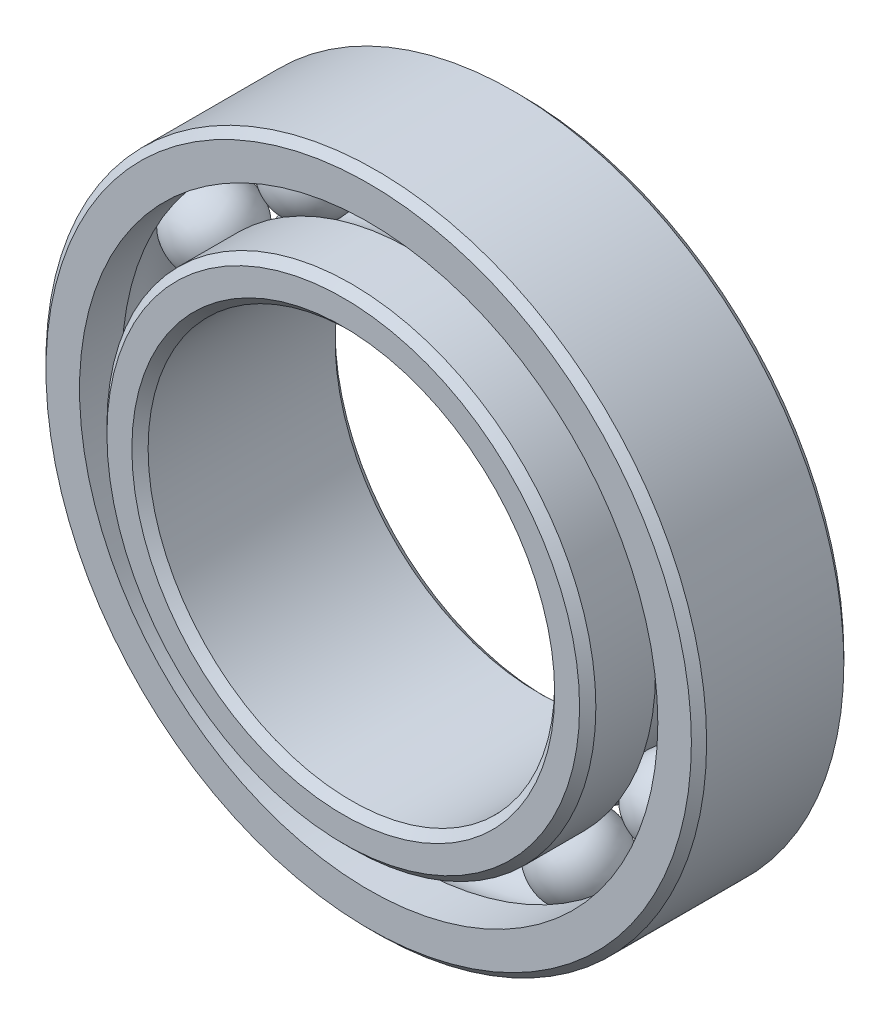
ISO-10303-21;
HEADER;
FILE_DESCRIPTION(('STEP AP214'),'2;1');
FILE_NAME('part.step','',(''),(''),'','','');
FILE_SCHEMA(('AUTOMOTIVE_DESIGN { 1 0 10303 214 1 1 1 1 }'));
ENDSEC;
DATA;
#1=APPLICATION_CONTEXT('core data for automotive mechanical design processes');
#2=APPLICATION_PROTOCOL_DEFINITION('international standard','automotive_design',2000,#1);
#3=PRODUCT_CONTEXT('',#1,'mechanical');
#4=PRODUCT('Part','Part','',(#3));
#5=PRODUCT_RELATED_PRODUCT_CATEGORY('part','',(#4));
#6=PRODUCT_DEFINITION_FORMATION('','',#4);
#7=PRODUCT_DEFINITION_CONTEXT('part definition',#1,'design');
#8=PRODUCT_DEFINITION('design','',#6,#7);
#9=PRODUCT_DEFINITION_SHAPE('','',#8);
#10=(LENGTH_UNIT() NAMED_UNIT(*) SI_UNIT(.MILLI.,.METRE.));
#11=(NAMED_UNIT(*) PLANE_ANGLE_UNIT() SI_UNIT($,.RADIAN.));
#12=(NAMED_UNIT(*) SI_UNIT($,.STERADIAN.) SOLID_ANGLE_UNIT());
#13=UNCERTAINTY_MEASURE_WITH_UNIT(LENGTH_MEASURE(1.E-05),#10,'distance_accuracy_value','');
#14=(GEOMETRIC_REPRESENTATION_CONTEXT(3) GLOBAL_UNCERTAINTY_ASSIGNED_CONTEXT((#13)) GLOBAL_UNIT_ASSIGNED_CONTEXT((#10,
#11,#12)) REPRESENTATION_CONTEXT('',''));
#15=CARTESIAN_POINT('',(0.,0.,0.));
#16=DIRECTION('',(0.,0.,1.));
#17=DIRECTION('',(1.,0.,0.));
#18=AXIS2_PLACEMENT_3D('',#15,#16,#17);
#19=CARTESIAN_POINT('',(-8.334375,14.4355609493326,0.));
#20=DIRECTION('',(0.,0.,1.0000000000001));
#21=DIRECTION('',(0.499999999999989,-0.866025403784445,0.));
#22=AXIS2_PLACEMENT_3D('',#19,#20,#21);
#23=SPHERICAL_SURFACE('',#22,2.53534798534798);
#24=CARTESIAN_POINT('',(-8.334375,14.4355609493326,2.53534798534823));
#25=VERTEX_POINT('',#24);
#26=VERTEX_LOOP('',#25);
#27=FACE_BOUND('',#26,.T.);
#28=ADVANCED_FACE('F43',(#27),#23,.T.);
#29=CLOSED_SHELL('',(#28));
#30=MANIFOLD_SOLID_BREP('B2',#29);
#31=CARTESIAN_POINT('',(-14.4355609493315,8.33437500000032,-1.23859256184744E-12));
#32=DIRECTION('',(0.,0.,1.0000000000001));
#33=DIRECTION('',(0.866025403784432,-0.50000000000001,0.));
#34=AXIS2_PLACEMENT_3D('',#31,#32,#33);
#35=SPHERICAL_SURFACE('',#34,2.53534798534798);
#36=CARTESIAN_POINT('',(-14.4355609493315,8.33437500000032,2.53534798534699));
#37=VERTEX_POINT('',#36);
#38=VERTEX_LOOP('',#37);
#39=FACE_BOUND('',#38,.T.);
#40=ADVANCED_FACE('F61',(#39),#35,.T.);
#41=CLOSED_SHELL('',(#40));
#42=MANIFOLD_SOLID_BREP('B6',#41);
#43=CARTESIAN_POINT('',(-16.6687499999997,1.73472347597681E-13,-1.21083698623181E-12));
#44=DIRECTION('',(0.,0.,1.0000000000001));
#45=DIRECTION('',(0.999999999999984,0.,0.));
#46=AXIS2_PLACEMENT_3D('',#43,#44,#45);
#47=SPHERICAL_SURFACE('',#46,2.53534798534798);
#48=CARTESIAN_POINT('',(-16.6687499999997,1.7344211046995E-13,2.53534798534702));
#49=VERTEX_POINT('',#48);
#50=VERTEX_LOOP('',#49);
#51=FACE_BOUND('',#50,.T.);
#52=ADVANCED_FACE('F79',(#51),#47,.T.);
#53=CLOSED_SHELL('',(#52));
#54=MANIFOLD_SOLID_BREP('B39',#53);
#55=CARTESIAN_POINT('',(-14.4355609493316,-8.3343749999995,-1.26634813746307E-12));
#56=DIRECTION('',(0.,0.,1.0000000000001));
#57=DIRECTION('',(0.866025403784443,0.499999999999992,0.));
#58=AXIS2_PLACEMENT_3D('',#55,#56,#57);
#59=SPHERICAL_SURFACE('',#58,2.53534798534798);
#60=CARTESIAN_POINT('',(-14.4355609493316,-8.3343749999995,2.53534798534697));
#61=VERTEX_POINT('',#60);
#62=VERTEX_LOOP('',#61);
#63=FACE_BOUND('',#62,.T.);
#64=ADVANCED_FACE('F97',(#63),#59,.T.);
#65=CLOSED_SHELL('',(#64));
#66=MANIFOLD_SOLID_BREP('B57',#65);
#67=CARTESIAN_POINT('',(-8.33437499999973,-14.4355609493317,-1.28369537222284E-12));
#68=DIRECTION('',(0.,0.,1.0000000000001));
#69=DIRECTION('',(0.500000000000002,0.866025403784435,0.));
#70=AXIS2_PLACEMENT_3D('',#67,#68,#69);
#71=SPHERICAL_SURFACE('',#70,2.53534798534798);
#72=CARTESIAN_POINT('',(-8.33437499999973,-14.4355609493317,2.53534798534694));
#73=VERTEX_POINT('',#72);
#74=VERTEX_LOOP('',#73);
#75=FACE_BOUND('',#74,.T.);
#76=ADVANCED_FACE('F115',(#75),#71,.T.);
#77=CLOSED_SHELL('',(#76));
#78=MANIFOLD_SOLID_BREP('B75',#77);
#79=CARTESIAN_POINT('',(-2.4980018054066E-13,-16.6687499999998,-1.15879528195251E-12));
#80=DIRECTION('',(0.,0.,1.0000000000001));
#81=DIRECTION('',(0.,0.999999999999999,0.));
#82=AXIS2_PLACEMENT_3D('',#79,#80,#81);
#83=SPHERICAL_SURFACE('',#82,2.53534798534798);
#84=CARTESIAN_POINT('',(-2.49950816413356E-13,-16.6687499999998,2.53534798534707));
#85=VERTEX_POINT('',#84);
#86=VERTEX_LOOP('',#85);
#87=FACE_BOUND('',#86,.T.);
#88=ADVANCED_FACE('F133',(#87),#83,.T.);
#89=CLOSED_SHELL('',(#88));
#90=MANIFOLD_SOLID_BREP('B93',#89);
#91=CARTESIAN_POINT('',(8.33437499999988,-14.4355609493318,-1.3392065234541E-12));
#92=DIRECTION('',(0.,0.,1.0000000000001));
#93=DIRECTION('',(-0.499999999999995,0.866025403784441,0.));
#94=AXIS2_PLACEMENT_3D('',#91,#92,#93);
#95=SPHERICAL_SURFACE('',#94,2.53534798534798);
#96=CARTESIAN_POINT('',(8.33437499999988,-14.4355609493318,2.53534798534689));
#97=VERTEX_POINT('',#96);
#98=VERTEX_LOOP('',#97);
#99=FACE_BOUND('',#98,.T.);
#100=ADVANCED_FACE('F151',(#99),#95,.T.);
#101=CLOSED_SHELL('',(#100));
#102=MANIFOLD_SOLID_BREP('B111',#101);
#103=CARTESIAN_POINT('',(14.435560949332,-8.33437500000023,-1.14144804719274E-12));
#104=DIRECTION('',(0.,0.,1.0000000000001));
#105=DIRECTION('',(-0.866025403784436,0.500000000000004,0.));
#106=AXIS2_PLACEMENT_3D('',#103,#104,#105);
#107=SPHERICAL_SURFACE('',#106,2.53534798534798);
#108=CARTESIAN_POINT('',(14.435560949332,-8.33437500000023,2.53534798534709));
#109=VERTEX_POINT('',#108);
#110=VERTEX_LOOP('',#109);
#111=FACE_BOUND('',#110,.T.);
#112=ADVANCED_FACE('F169',(#111),#107,.T.);
#113=CLOSED_SHELL('',(#112));
#114=MANIFOLD_SOLID_BREP('B129',#113);
#115=CARTESIAN_POINT('',(16.6687499999999,1.04083408558608E-13,-1.26287869051112E-12));
#116=DIRECTION('',(0.,0.,1.0000000000001));
#117=DIRECTION('',(-0.999999999999988,0.,0.));
#118=AXIS2_PLACEMENT_3D('',#115,#116,#117);
#119=SPHERICAL_SURFACE('',#118,2.53534798534798);
#120=CARTESIAN_POINT('',(16.6687499999999,1.04050422601084E-13,2.53534798534697));
#121=VERTEX_POINT('',#120);
#122=VERTEX_LOOP('',#121);
#123=FACE_BOUND('',#122,.T.);
#124=ADVANCED_FACE('F187',(#123),#119,.T.);
#125=CLOSED_SHELL('',(#124));
#126=MANIFOLD_SOLID_BREP('B147',#125);
#127=CARTESIAN_POINT('',(14.4355609493318,8.33437500000012,-1.19002030452009E-12));
#128=DIRECTION('',(0.,0.,1.0000000000001));
#129=DIRECTION('',(-0.866025403784432,-0.499999999999995,0.));
#130=AXIS2_PLACEMENT_3D('',#127,#128,#129);
#131=SPHERICAL_SURFACE('',#130,2.53534798534798);
#132=CARTESIAN_POINT('',(14.4355609493318,8.33437500000012,2.53534798534704));
#133=VERTEX_POINT('',#132);
#134=VERTEX_LOOP('',#133);
#135=FACE_BOUND('',#134,.T.);
#136=ADVANCED_FACE('F205',(#135),#131,.T.);
#137=CLOSED_SHELL('',(#136));
#138=MANIFOLD_SOLID_BREP('B165',#137);
#139=CARTESIAN_POINT('',(8.33437499999982,14.4355609493321,-1.21083698623181E-12));
#140=DIRECTION('',(0.,0.,1.0000000000001));
#141=DIRECTION('',(-0.5,-0.866025403784438,0.));
#142=AXIS2_PLACEMENT_3D('',#139,#140,#141);
#143=SPHERICAL_SURFACE('',#142,2.53534798534798);
#144=CARTESIAN_POINT('',(8.33437499999982,14.4355609493321,2.53534798534702));
#145=VERTEX_POINT('',#144);
#146=VERTEX_LOOP('',#145);
#147=FACE_BOUND('',#146,.T.);
#148=ADVANCED_FACE('F223',(#147),#143,.T.);
#149=CLOSED_SHELL('',(#148));
#150=MANIFOLD_SOLID_BREP('B183',#149);
#151=CARTESIAN_POINT('',(-2.22044604925031E-13,16.6687500000001,0.));
#152=DIRECTION('',(0.,0.,1.0000000000001));
#153=DIRECTION('',(0.,-1.,0.));
#154=AXIS2_PLACEMENT_3D('',#151,#152,#153);
#155=SPHERICAL_SURFACE('',#154,2.53534798534798);
#156=CARTESIAN_POINT('',(-2.22197439861562E-13,16.6687500000001,2.53534798534826));
#157=VERTEX_POINT('',#156);
#158=VERTEX_LOOP('',#157);
#159=FACE_BOUND('',#158,.T.);
#160=ADVANCED_FACE('F244',(#159),#155,.T.);
#161=CLOSED_SHELL('',(#160));
#162=MANIFOLD_SOLID_BREP('B201',#161);
#163=CARTESIAN_POINT('',(0.,0.,0.));
#164=DIRECTION('',(0.,0.,1.0000000000001));
#165=DIRECTION('',(0.999999999999982,0.,0.));
#166=AXIS2_PLACEMENT_3D('',#163,#164,#165);
#167=TOROIDAL_SURFACE('',#166,16.66875,2.53534798534798);
#168=CARTESIAN_POINT('',(-2.77555756156289E-13,1.38777878078145E-13,2.11666666666694));
#169=DIRECTION('',(0.,0.,1.0000000000001));
#170=DIRECTION('',(0.999999999999982,0.,0.));
#171=AXIS2_PLACEMENT_3D('',#168,#169,#170);
#172=CIRCLE('',#171,15.2731456043956);
#173=CARTESIAN_POINT('',(15.2731456043951,0.,2.11666666666694));
#174=VERTEX_POINT('',#173);
#175=EDGE_CURVE('E296',#174,#174,#172,.T.);
#176=ORIENTED_EDGE('',*,*,#175,.F.);
#177=EDGE_LOOP('',(#176));
#178=FACE_BOUND('',#177,.T.);
#179=CARTESIAN_POINT('',(-2.08166817117217E-13,1.66533453693773E-13,-2.11666666666796));
#180=DIRECTION('',(0.,0.,1.0000000000001));
#181=DIRECTION('',(0.999999999999982,0.,0.));
#182=AXIS2_PLACEMENT_3D('',#179,#180,#181);
#183=CIRCLE('',#182,15.2731456043956);
#184=CARTESIAN_POINT('',(15.2731456043951,0.,-2.11666666666796));
#185=VERTEX_POINT('',#184);
#186=EDGE_CURVE('E293',#185,#185,#183,.T.);
#187=ORIENTED_EDGE('',*,*,#186,.T.);
#188=EDGE_LOOP('',(#187));
#189=FACE_BOUND('',#188,.T.);
#190=ADVANCED_FACE('F262',(#178,#189),#167,.F.);
#191=CARTESIAN_POINT('',(2.4980018054066E-13,2.77555756156289E-13,4.76250000000033));
#192=DIRECTION('',(0.,0.,1.0000000000001));
#193=DIRECTION('',(0.999999999999982,0.,0.));
#194=AXIS2_PLACEMENT_3D('',#191,#192,#193);
#195=CYLINDRICAL_SURFACE('',#194,15.2731456043956);
#196=CARTESIAN_POINT('',(-5.82867087928207E-13,1.06165076729781E-12,-5.84200000000136));
#197=DIRECTION('',(0.,0.,1.0000000000001));
#198=DIRECTION('',(0.999999999999982,0.,0.));
#199=AXIS2_PLACEMENT_3D('',#196,#197,#198);
#200=CIRCLE('',#199,15.2731456043956);
#201=CARTESIAN_POINT('',(15.2731456043948,9.69316857433723E-13,-5.84200000000136));
#202=VERTEX_POINT('',#201);
#203=EDGE_CURVE('E290',#202,#202,#200,.T.);
#204=ORIENTED_EDGE('',*,*,#203,.T.);
#205=EDGE_LOOP('',(#204));
#206=FACE_BOUND('',#205,.T.);
#207=ORIENTED_EDGE('',*,*,#186,.F.);
#208=EDGE_LOOP('',(#207));
#209=FACE_BOUND('',#208,.T.);
#210=ADVANCED_FACE('F304',(#206,#209),#195,.T.);
#211=CARTESIAN_POINT('',(-4.44089209850063E-13,15.273145604396,-6.35000000000172));
#212=DIRECTION('',(0.,0.,1.0000000000001));
#213=DIRECTION('',(0.999999999999982,0.,0.));
#214=AXIS2_PLACEMENT_3D('',#211,#212,#213);
#215=PLANE('',#214);
#216=CARTESIAN_POINT('',(-1.11022302462516E-13,2.42861286636753E-13,-6.35000000000153));
#217=DIRECTION('',(0.,0.,1.0000000000001));
#218=DIRECTION('',(0.999999999999982,0.,0.));
#219=AXIS2_PLACEMENT_3D('',#216,#217,#218);
#220=CIRCLE('',#219,14.7651456043956);
#221=CARTESIAN_POINT('',(14.7651456043952,1.53598494368607E-13,-6.35000000000153));
#222=VERTEX_POINT('',#221);
#223=EDGE_CURVE('E284',#222,#222,#220,.F.);
#224=ORIENTED_EDGE('',*,*,#223,.T.);
#225=EDGE_LOOP('',(#224));
#226=FACE_BOUND('',#225,.T.);
#227=CARTESIAN_POINT('',(-1.11022302462516E-13,2.42861286636753E-13,-6.35000000000153));
#228=DIRECTION('',(0.,0.,1.0000000000001));
#229=DIRECTION('',(0.999999999999982,0.,0.));
#230=AXIS2_PLACEMENT_3D('',#227,#228,#229);
#231=CIRCLE('',#230,13.208);
#232=CARTESIAN_POINT('',(13.2079999999997,1.63012229142413E-13,-6.35000000000153));
#233=VERTEX_POINT('',#232);
#234=EDGE_CURVE('E287',#233,#233,#231,.T.);
#235=ORIENTED_EDGE('',*,*,#234,.T.);
#236=EDGE_LOOP('',(#235));
#237=FACE_BOUND('',#236,.T.);
#238=ADVANCED_FACE('F308',(#226,#237),#215,.F.);
#239=CARTESIAN_POINT('',(2.4980018054066E-13,2.77555756156289E-13,4.76250000000033));
#240=DIRECTION('',(0.,0.,1.0000000000001));
#241=DIRECTION('',(0.999999999999982,0.,0.));
#242=AXIS2_PLACEMENT_3D('',#239,#240,#241);
#243=CYLINDRICAL_SURFACE('',#242,12.7);
#244=CARTESIAN_POINT('',(-5.82867087928207E-13,1.06165076729781E-12,-5.84200000000136));
#245=DIRECTION('',(0.,0.,1.0000000000001));
#246=DIRECTION('',(0.999999999999982,0.,0.));
#247=AXIS2_PLACEMENT_3D('',#244,#245,#246);
#248=CIRCLE('',#247,12.7);
#249=CARTESIAN_POINT('',(12.6999999999992,9.84872827399403E-13,-5.84200000000136));
#250=VERTEX_POINT('',#249);
#251=EDGE_CURVE('E276',#250,#250,#248,.F.);
#252=ORIENTED_EDGE('',*,*,#251,.T.);
#253=EDGE_LOOP('',(#252));
#254=FACE_BOUND('',#253,.T.);
#255=CARTESIAN_POINT('',(1.94289029309402E-13,1.38777878078145E-13,5.84199999999908));
#256=DIRECTION('',(0.,0.,-1.0000000000001));
#257=DIRECTION('',(-0.999999999999982,0.,0.));
#258=AXIS2_PLACEMENT_3D('',#255,#256,#257);
#259=CIRCLE('',#258,12.7);
#260=CARTESIAN_POINT('',(-12.6999999999996,2.15555817976548E-13,5.84199999999908));
#261=VERTEX_POINT('',#260);
#262=EDGE_CURVE('E281',#261,#261,#259,.F.);
#263=ORIENTED_EDGE('',*,*,#262,.T.);
#264=EDGE_LOOP('',(#263));
#265=FACE_BOUND('',#264,.T.);
#266=ADVANCED_FACE('F313',(#254,#265),#243,.F.);
#267=CARTESIAN_POINT('',(0.,15.2731456043959,6.35000000000046));
#268=DIRECTION('',(0.,0.,-1.0000000000001));
#269=DIRECTION('',(-0.999999999999982,0.,0.));
#270=AXIS2_PLACEMENT_3D('',#267,#268,#269);
#271=PLANE('',#270);
#272=CARTESIAN_POINT('',(-3.33066907387547E-13,2.0122792321331E-13,6.34999999999931));
#273=DIRECTION('',(0.,0.,-1.0000000000001));
#274=DIRECTION('',(-0.999999999999982,0.,0.));
#275=AXIS2_PLACEMENT_3D('',#272,#273,#274);
#276=CIRCLE('',#275,13.208);
#277=CARTESIAN_POINT('',(-13.2080000000001,2.81076980707649E-13,6.34999999999931));
#278=VERTEX_POINT('',#277);
#279=EDGE_CURVE('E268',#278,#278,#276,.T.);
#280=ORIENTED_EDGE('',*,*,#279,.T.);
#281=EDGE_LOOP('',(#280));
#282=FACE_BOUND('',#281,.T.);
#283=CARTESIAN_POINT('',(-3.33066907387547E-13,2.0122792321331E-13,6.34999999999931));
#284=DIRECTION('',(0.,0.,-1.0000000000001));
#285=DIRECTION('',(-0.999999999999982,0.,0.));
#286=AXIS2_PLACEMENT_3D('',#283,#284,#285);
#287=CIRCLE('',#286,14.7651456043956);
#288=CARTESIAN_POINT('',(-14.7651456043957,2.90490715481456E-13,6.34999999999931));
#289=VERTEX_POINT('',#288);
#290=EDGE_CURVE('E272',#289,#289,#287,.F.);
#291=ORIENTED_EDGE('',*,*,#290,.T.);
#292=EDGE_LOOP('',(#291));
#293=FACE_BOUND('',#292,.T.);
#294=ADVANCED_FACE('F319',(#282,#293),#271,.F.);
#295=CARTESIAN_POINT('',(2.4980018054066E-13,2.77555756156289E-13,4.76250000000033));
#296=DIRECTION('',(0.,0.,1.0000000000001));
#297=DIRECTION('',(0.999999999999982,0.,0.));
#298=AXIS2_PLACEMENT_3D('',#295,#296,#297);
#299=CYLINDRICAL_SURFACE('',#298,15.2731456043956);
#300=CARTESIAN_POINT('',(1.94289029309402E-13,1.38777878078145E-13,5.84199999999908));
#301=DIRECTION('',(0.,0.,-1.0000000000001));
#302=DIRECTION('',(-0.999999999999982,0.,0.));
#303=AXIS2_PLACEMENT_3D('',#300,#301,#302);
#304=CIRCLE('',#303,15.2731456043956);
#305=CARTESIAN_POINT('',(-15.2731456043951,2.31111787942227E-13,5.84199999999908));
#306=VERTEX_POINT('',#305);
#307=EDGE_CURVE('E243',#306,#306,#304,.T.);
#308=ORIENTED_EDGE('',*,*,#307,.T.);
#309=EDGE_LOOP('',(#308));
#310=FACE_BOUND('',#309,.T.);
#311=ORIENTED_EDGE('',*,*,#175,.T.);
#312=EDGE_LOOP('',(#311));
#313=FACE_BOUND('',#312,.T.);
#314=ADVANCED_FACE('F300',(#310,#313),#299,.T.);
#315=CARTESIAN_POINT('',(-5.82867087928207E-13,1.06165076729781E-12,-5.84200000000136));
#316=DIRECTION('',(0.,0.,1.0000000000001));
#317=DIRECTION('',(0.999999999999982,0.,0.));
#318=AXIS2_PLACEMENT_3D('',#315,#316,#317);
#319=CONICAL_SURFACE('',#318,15.2731456043956,0.785398163397453);
#320=ORIENTED_EDGE('',*,*,#223,.F.);
#321=EDGE_LOOP('',(#320));
#322=FACE_BOUND('',#321,.T.);
#323=ORIENTED_EDGE('',*,*,#203,.F.);
#324=EDGE_LOOP('',(#323));
#325=FACE_BOUND('',#324,.T.);
#326=ADVANCED_FACE('F325',(#322,#325),#319,.T.);
#327=CARTESIAN_POINT('',(-1.11022302462516E-13,2.42861286636753E-13,-6.35000000000153));
#328=DIRECTION('',(0.,0.,-1.0000000000001));
#329=DIRECTION('',(-0.999999999999982,0.,0.));
#330=AXIS2_PLACEMENT_3D('',#327,#328,#329);
#331=CONICAL_SURFACE('',#330,13.208,0.785398163397445);
#332=ORIENTED_EDGE('',*,*,#251,.F.);
#333=EDGE_LOOP('',(#332));
#334=FACE_BOUND('',#333,.T.);
#335=ORIENTED_EDGE('',*,*,#234,.F.);
#336=EDGE_LOOP('',(#335));
#337=FACE_BOUND('',#336,.T.);
#338=ADVANCED_FACE('F328',(#334,#337),#331,.F.);
#339=CARTESIAN_POINT('',(1.94289029309402E-13,1.38777878078145E-13,5.84199999999908));
#340=DIRECTION('',(0.,0.,1.0000000000001));
#341=DIRECTION('',(0.999999999999982,0.,0.));
#342=AXIS2_PLACEMENT_3D('',#339,#340,#341);
#343=CONICAL_SURFACE('',#342,12.7,0.785398163397448);
#344=ORIENTED_EDGE('',*,*,#279,.F.);
#345=EDGE_LOOP('',(#344));
#346=FACE_BOUND('',#345,.T.);
#347=ORIENTED_EDGE('',*,*,#262,.F.);
#348=EDGE_LOOP('',(#347));
#349=FACE_BOUND('',#348,.T.);
#350=ADVANCED_FACE('F332',(#346,#349),#343,.F.);
#351=CARTESIAN_POINT('',(-3.33066907387547E-13,2.0122792321331E-13,6.34999999999931));
#352=DIRECTION('',(0.,0.,-1.0000000000001));
#353=DIRECTION('',(-0.999999999999982,0.,0.));
#354=AXIS2_PLACEMENT_3D('',#351,#352,#353);
#355=CONICAL_SURFACE('',#354,14.7651456043956,0.785398163397453);
#356=ORIENTED_EDGE('',*,*,#307,.F.);
#357=EDGE_LOOP('',(#356));
#358=FACE_BOUND('',#357,.T.);
#359=ORIENTED_EDGE('',*,*,#290,.F.);
#360=EDGE_LOOP('',(#359));
#361=FACE_BOUND('',#360,.T.);
#362=ADVANCED_FACE('F336',(#358,#361),#355,.T.);
#363=CLOSED_SHELL('',(#190,#210,#238,#266,#294,#314,#326,#338,#350,#362));
#364=MANIFOLD_SOLID_BREP('B219',#363);
#365=CARTESIAN_POINT('',(0.,0.,4.28624999999997));
#366=DIRECTION('',(0.,0.,-1.0000000000001));
#367=DIRECTION('',(-0.999999999999982,0.,0.));
#368=AXIS2_PLACEMENT_3D('',#365,#366,#367);
#369=CONICAL_SURFACE('',#368,20.6375,0.785398163397449);
#370=CARTESIAN_POINT('',(1.66533453693773E-13,3.53883589099269E-13,4.76250000000033));
#371=DIRECTION('',(0.,0.,1.0000000000001));
#372=DIRECTION('',(0.999999999999982,0.,0.));
#373=AXIS2_PLACEMENT_3D('',#370,#371,#372);
#374=CIRCLE('',#373,20.16125);
#375=CARTESIAN_POINT('',(20.1612499999998,2.31998609510553E-13,4.76250000000033));
#376=VERTEX_POINT('',#375);
#377=EDGE_CURVE('E422',#376,#376,#374,.T.);
#378=ORIENTED_EDGE('',*,*,#377,.F.);
#379=EDGE_LOOP('',(#378));
#380=FACE_BOUND('',#379,.T.);
#381=CARTESIAN_POINT('',(0.,0.,4.28624999999997));
#382=DIRECTION('',(0.,0.,1.0000000000001));
#383=DIRECTION('',(0.999999999999982,0.,0.));
#384=AXIS2_PLACEMENT_3D('',#381,#382,#383);
#385=CIRCLE('',#384,20.6375);
#386=CARTESIAN_POINT('',(20.6374999999997,-1.73336409662256E-13,4.28624999999997));
#387=VERTEX_POINT('',#386);
#388=EDGE_CURVE('E261',#387,#387,#385,.T.);
#389=ORIENTED_EDGE('',*,*,#388,.T.);
#390=EDGE_LOOP('',(#389));
#391=FACE_BOUND('',#390,.T.);
#392=ADVANCED_FACE('F394',(#380,#391),#369,.T.);
#393=CARTESIAN_POINT('',(1.66533453693773E-13,3.53883589099269E-13,4.76250000000033));
#394=DIRECTION('',(0.,0.,1.0000000000001));
#395=DIRECTION('',(0.999999999999982,0.,0.));
#396=AXIS2_PLACEMENT_3D('',#393,#394,#395);
#397=CYLINDRICAL_SURFACE('',#396,20.6375);
#398=ORIENTED_EDGE('',*,*,#388,.F.);
#399=EDGE_LOOP('',(#398));
#400=FACE_BOUND('',#399,.T.);
#401=CARTESIAN_POINT('',(3.33066907387547E-13,1.87350135405495E-13,-4.2862500000017));
#402=DIRECTION('',(0.,0.,1.0000000000001));
#403=DIRECTION('',(0.999999999999982,0.,0.));
#404=AXIS2_PLACEMENT_3D('',#401,#402,#403);
#405=CIRCLE('',#404,20.6375);
#406=CARTESIAN_POINT('',(20.6375,0.,-4.2862500000017));
#407=VERTEX_POINT('',#406);
#408=EDGE_CURVE('E400',#407,#407,#405,.T.);
#409=ORIENTED_EDGE('',*,*,#408,.T.);
#410=EDGE_LOOP('',(#409));
#411=FACE_BOUND('',#410,.T.);
#412=ADVANCED_FACE('F429',(#400,#411),#397,.T.);
#413=CARTESIAN_POINT('',(0.,0.,-4.76250000000167));
#414=DIRECTION('',(0.,0.,1.0000000000001));
#415=DIRECTION('',(0.999999999999982,0.,0.));
#416=AXIS2_PLACEMENT_3D('',#413,#414,#415);
#417=CONICAL_SURFACE('',#416,20.16125,0.78539816339745);
#418=ORIENTED_EDGE('',*,*,#408,.F.);
#419=EDGE_LOOP('',(#418));
#420=FACE_BOUND('',#419,.T.);
#421=CARTESIAN_POINT('',(0.,0.,-4.76250000000167));
#422=DIRECTION('',(0.,0.,1.0000000000001));
#423=DIRECTION('',(0.999999999999982,0.,0.));
#424=AXIS2_PLACEMENT_3D('',#421,#422,#423);
#425=CIRCLE('',#424,20.16125);
#426=CARTESIAN_POINT('',(20.1612499999997,0.,-4.76250000000167));
#427=VERTEX_POINT('',#426);
#428=EDGE_CURVE('E404',#427,#427,#425,.T.);
#429=ORIENTED_EDGE('',*,*,#428,.T.);
#430=EDGE_LOOP('',(#429));
#431=FACE_BOUND('',#430,.T.);
#432=ADVANCED_FACE('F433',(#420,#431),#417,.T.);
#433=CARTESIAN_POINT('',(1.11022302462516E-13,20.1612500000001,-4.76250000000166));
#434=DIRECTION('',(0.,0.,1.0000000000001));
#435=DIRECTION('',(0.999999999999982,0.,0.));
#436=AXIS2_PLACEMENT_3D('',#433,#434,#435);
#437=PLANE('',#436);
#438=ORIENTED_EDGE('',*,*,#428,.F.);
#439=EDGE_LOOP('',(#438));
#440=FACE_BOUND('',#439,.T.);
#441=CARTESIAN_POINT('',(0.,0.,-4.76250000000167));
#442=DIRECTION('',(0.,0.,1.0000000000001));
#443=DIRECTION('',(0.999999999999982,0.,0.));
#444=AXIS2_PLACEMENT_3D('',#441,#442,#443);
#445=CIRCLE('',#444,18.0643543956044);
#446=CARTESIAN_POINT('',(18.0643543956042,0.,-4.76250000000167));
#447=VERTEX_POINT('',#446);
#448=EDGE_CURVE('E408',#447,#447,#445,.T.);
#449=ORIENTED_EDGE('',*,*,#448,.T.);
#450=EDGE_LOOP('',(#449));
#451=FACE_BOUND('',#450,.T.);
#452=ADVANCED_FACE('F438',(#440,#451),#437,.F.);
#453=CARTESIAN_POINT('',(1.66533453693773E-13,3.53883589099269E-13,4.76250000000033));
#454=DIRECTION('',(0.,0.,1.0000000000001));
#455=DIRECTION('',(0.999999999999982,0.,0.));
#456=AXIS2_PLACEMENT_3D('',#453,#454,#455);
#457=CYLINDRICAL_SURFACE('',#456,18.0643543956044);
#458=ORIENTED_EDGE('',*,*,#448,.F.);
#459=EDGE_LOOP('',(#458));
#460=FACE_BOUND('',#459,.T.);
#461=CARTESIAN_POINT('',(1.2490009027033E-13,3.19189119579733E-13,-2.11666666666801));
#462=DIRECTION('',(0.,0.,1.0000000000001));
#463=DIRECTION('',(0.999999999999982,0.,0.));
#464=AXIS2_PLACEMENT_3D('',#461,#462,#463);
#465=CIRCLE('',#464,18.0643543956044);
#466=CARTESIAN_POINT('',(18.0643543956042,2.09980937210506E-13,-2.11666666666801));
#467=VERTEX_POINT('',#466);
#468=EDGE_CURVE('E413',#467,#467,#465,.T.);
#469=ORIENTED_EDGE('',*,*,#468,.T.);
#470=EDGE_LOOP('',(#469));
#471=FACE_BOUND('',#470,.T.);
#472=ADVANCED_FACE('F444',(#460,#471),#457,.F.);
#473=CARTESIAN_POINT('',(0.,0.,0.));
#474=DIRECTION('',(0.,0.,1.0000000000001));
#475=DIRECTION('',(0.999999999999982,0.,0.));
#476=AXIS2_PLACEMENT_3D('',#473,#474,#475);
#477=TOROIDAL_SURFACE('',#476,16.66875,2.53534798534798);
#478=ORIENTED_EDGE('',*,*,#468,.F.);
#479=EDGE_LOOP('',(#478));
#480=FACE_BOUND('',#479,.T.);
#481=CARTESIAN_POINT('',(0.,2.84494650060196E-13,2.11666666666699));
#482=DIRECTION('',(0.,0.,1.0000000000001));
#483=DIRECTION('',(0.999999999999982,0.,0.));
#484=AXIS2_PLACEMENT_3D('',#481,#482,#483);
#485=CIRCLE('',#484,18.0643543956044);
#486=CARTESIAN_POINT('',(18.064354395604,1.7528646769097E-13,2.11666666666698));
#487=VERTEX_POINT('',#486);
#488=EDGE_CURVE('E416',#487,#487,#485,.T.);
#489=ORIENTED_EDGE('',*,*,#488,.T.);
#490=EDGE_LOOP('',(#489));
#491=FACE_BOUND('',#490,.T.);
#492=ADVANCED_FACE('F448',(#480,#491),#477,.F.);
#493=CARTESIAN_POINT('',(1.66533453693773E-13,3.53883589099269E-13,4.76250000000033));
#494=DIRECTION('',(0.,0.,1.0000000000001));
#495=DIRECTION('',(0.999999999999982,0.,0.));
#496=AXIS2_PLACEMENT_3D('',#493,#494,#495);
#497=CYLINDRICAL_SURFACE('',#496,18.0643543956044);
#498=ORIENTED_EDGE('',*,*,#488,.F.);
#499=EDGE_LOOP('',(#498));
#500=FACE_BOUND('',#499,.T.);
#501=CARTESIAN_POINT('',(1.66533453693773E-13,3.53883589099269E-13,4.76250000000033));
#502=DIRECTION('',(0.,0.,1.0000000000001));
#503=DIRECTION('',(0.999999999999982,0.,0.));
#504=AXIS2_PLACEMENT_3D('',#501,#502,#503);
#505=CIRCLE('',#504,18.0643543956044);
#506=CARTESIAN_POINT('',(18.0643543956042,2.44675406730042E-13,4.76250000000033));
#507=VERTEX_POINT('',#506);
#508=EDGE_CURVE('E419',#507,#507,#505,.T.);
#509=ORIENTED_EDGE('',*,*,#508,.T.);
#510=EDGE_LOOP('',(#509));
#511=FACE_BOUND('',#510,.T.);
#512=ADVANCED_FACE('F452',(#500,#511),#497,.F.);
#513=CARTESIAN_POINT('',(1.52655665885959E-13,20.1612500000004,4.76249999999928));
#514=DIRECTION('',(0.,0.,-1.0000000000001));
#515=DIRECTION('',(-0.999999999999982,0.,0.));
#516=AXIS2_PLACEMENT_3D('',#513,#514,#515);
#517=PLANE('',#516);
#518=ORIENTED_EDGE('',*,*,#508,.F.);
#519=EDGE_LOOP('',(#518));
#520=FACE_BOUND('',#519,.T.);
#521=ORIENTED_EDGE('',*,*,#377,.T.);
#522=EDGE_LOOP('',(#521));
#523=FACE_BOUND('',#522,.T.);
#524=ADVANCED_FACE('F426',(#520,#523),#517,.F.);
#525=CLOSED_SHELL('',(#392,#412,#432,#452,#472,#492,#512,#524));
#526=MANIFOLD_SOLID_BREP('B238',#525);
#527=ADVANCED_BREP_SHAPE_REPRESENTATION('',(#18,#30,#42,#54,#66,#78,#90,#102,#114,#126,#138,
#150,#162,#364,#526),#14);
#528=SHAPE_DEFINITION_REPRESENTATION(#9,#527);
ENDSEC;
END-ISO-10303-21;
